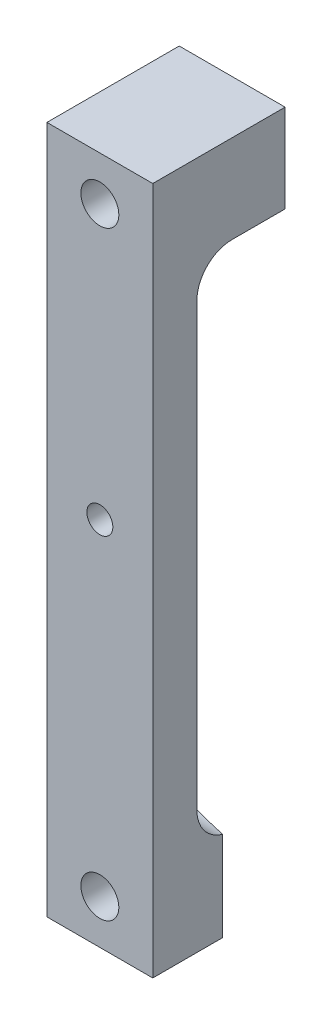
ISO-10303-21;
HEADER;
FILE_DESCRIPTION(('STEP AP214'),'2;1');
FILE_NAME('part.step','',(''),(''),'','','');
FILE_SCHEMA(('AUTOMOTIVE_DESIGN { 1 0 10303 214 1 1 1 1 }'));
ENDSEC;
DATA;
#1=APPLICATION_CONTEXT('core data for automotive mechanical design processes');
#2=APPLICATION_PROTOCOL_DEFINITION('international standard','automotive_design',2000,#1);
#3=PRODUCT_CONTEXT('',#1,'mechanical');
#4=PRODUCT('Part','Part','',(#3));
#5=PRODUCT_RELATED_PRODUCT_CATEGORY('part','',(#4));
#6=PRODUCT_DEFINITION_FORMATION('','',#4);
#7=PRODUCT_DEFINITION_CONTEXT('part definition',#1,'design');
#8=PRODUCT_DEFINITION('design','',#6,#7);
#9=PRODUCT_DEFINITION_SHAPE('','',#8);
#10=(LENGTH_UNIT() NAMED_UNIT(*) SI_UNIT(.MILLI.,.METRE.));
#11=(NAMED_UNIT(*) PLANE_ANGLE_UNIT() SI_UNIT($,.RADIAN.));
#12=(NAMED_UNIT(*) SI_UNIT($,.STERADIAN.) SOLID_ANGLE_UNIT());
#13=UNCERTAINTY_MEASURE_WITH_UNIT(LENGTH_MEASURE(1.E-05),#10,'distance_accuracy_value','');
#14=(GEOMETRIC_REPRESENTATION_CONTEXT(3) GLOBAL_UNCERTAINTY_ASSIGNED_CONTEXT((#13)) GLOBAL_UNIT_ASSIGNED_CONTEXT((#10,
#11,#12)) REPRESENTATION_CONTEXT('',''));
#15=CARTESIAN_POINT('',(0.,0.,0.));
#16=DIRECTION('',(0.,0.,1.));
#17=DIRECTION('',(1.,0.,0.));
#18=AXIS2_PLACEMENT_3D('',#15,#16,#17);
#19=CARTESIAN_POINT('',(0.,39.,0.));
#20=DIRECTION('',(0.,0.,1.));
#21=DIRECTION('',(1.,0.,0.));
#22=AXIS2_PLACEMENT_3D('',#19,#20,#21);
#23=PLANE('',#22);
#24=CARTESIAN_POINT('',(6.00000000000001,3.,0.));
#25=DIRECTION('',(0.,0.,1.));
#26=DIRECTION('',(1.,0.,0.));
#27=AXIS2_PLACEMENT_3D('',#24,#25,#26);
#28=CIRCLE('',#27,1.4732);
#29=CARTESIAN_POINT('',(7.47320000000001,3.,0.));
#30=VERTEX_POINT('',#29);
#31=EDGE_CURVE('E158',#30,#30,#28,.T.);
#32=ORIENTED_EDGE('',*,*,#31,.T.);
#33=EDGE_LOOP('',(#32));
#34=FACE_BOUND('',#33,.T.);
#35=DIRECTION('',(0.,1.,0.));
#36=VECTOR('',#35,1.);
#37=CARTESIAN_POINT('',(12.,0.,0.));
#38=LINE('',#37,#36);
#39=CARTESIAN_POINT('',(12.,-25.,0.));
#40=VERTEX_POINT('',#39);
#41=CARTESIAN_POINT('',(12.,25.,0.));
#42=VERTEX_POINT('',#41);
#43=EDGE_CURVE('E157',#40,#42,#38,.T.);
#44=ORIENTED_EDGE('',*,*,#43,.F.);
#45=DIRECTION('',(1.,0.,0.));
#46=VECTOR('',#45,1.);
#47=CARTESIAN_POINT('',(0.,-25.,0.));
#48=LINE('',#47,#46);
#49=CARTESIAN_POINT('',(0.,-25.,0.));
#50=VERTEX_POINT('',#49);
#51=EDGE_CURVE('E358',#40,#50,#48,.F.);
#52=ORIENTED_EDGE('',*,*,#51,.T.);
#53=DIRECTION('',(0.,-1.,0.));
#54=VECTOR('',#53,1.);
#55=CARTESIAN_POINT('',(0.,39.,0.));
#56=LINE('',#55,#54);
#57=CARTESIAN_POINT('',(0.,25.,0.));
#58=VERTEX_POINT('',#57);
#59=EDGE_CURVE('E153',#58,#50,#56,.T.);
#60=ORIENTED_EDGE('',*,*,#59,.F.);
#61=DIRECTION('',(-1.,0.,0.));
#62=VECTOR('',#61,1.);
#63=CARTESIAN_POINT('',(12.,25.,0.));
#64=LINE('',#63,#62);
#65=EDGE_CURVE('E152',#58,#42,#64,.F.);
#66=ORIENTED_EDGE('',*,*,#65,.T.);
#67=EDGE_LOOP('',(#44,#52,#60,#66));
#68=FACE_BOUND('',#67,.T.);
#69=ADVANCED_FACE('F32',(#34,#68),#23,.F.);
#70=CARTESIAN_POINT('',(12.,39.,5.));
#71=DIRECTION('',(0.,-1.,0.));
#72=DIRECTION('',(0.,0.,-1.));
#73=AXIS2_PLACEMENT_3D('',#70,#71,#72);
#74=PLANE('',#73);
#75=DIRECTION('',(0.,0.,-1.));
#76=VECTOR('',#75,1.);
#77=CARTESIAN_POINT('',(12.,39.,5.));
#78=LINE('',#77,#76);
#79=CARTESIAN_POINT('',(12.,39.,5.));
#80=VERTEX_POINT('',#79);
#81=CARTESIAN_POINT('',(12.,39.,-9.99999999999999));
#82=VERTEX_POINT('',#81);
#83=EDGE_CURVE('E135',#80,#82,#78,.T.);
#84=ORIENTED_EDGE('',*,*,#83,.T.);
#85=DIRECTION('',(1.,0.,0.));
#86=VECTOR('',#85,1.);
#87=CARTESIAN_POINT('',(0.,39.,-9.99999999999999));
#88=LINE('',#87,#86);
#89=CARTESIAN_POINT('',(0.,39.,-9.99999999999999));
#90=VERTEX_POINT('',#89);
#91=EDGE_CURVE('E179',#90,#82,#88,.T.);
#92=ORIENTED_EDGE('',*,*,#91,.F.);
#93=DIRECTION('',(0.,0.,-1.));
#94=VECTOR('',#93,1.);
#95=CARTESIAN_POINT('',(0.,39.,5.));
#96=LINE('',#95,#94);
#97=CARTESIAN_POINT('',(0.,39.,5.));
#98=VERTEX_POINT('',#97);
#99=EDGE_CURVE('E130',#98,#90,#96,.T.);
#100=ORIENTED_EDGE('',*,*,#99,.F.);
#101=DIRECTION('',(-1.,0.,0.));
#102=VECTOR('',#101,1.);
#103=CARTESIAN_POINT('',(12.,39.,5.));
#104=LINE('',#103,#102);
#105=EDGE_CURVE('E166',#80,#98,#104,.T.);
#106=ORIENTED_EDGE('',*,*,#105,.F.);
#107=EDGE_LOOP('',(#84,#92,#100,#106));
#108=FACE_BOUND('',#107,.T.);
#109=ADVANCED_FACE('F34',(#108),#74,.F.);
#110=CARTESIAN_POINT('',(0.,39.,5.));
#111=DIRECTION('',(1.,0.,0.));
#112=DIRECTION('',(0.,0.,-1.));
#113=AXIS2_PLACEMENT_3D('',#110,#111,#112);
#114=PLANE('',#113);
#115=DIRECTION('',(0.,0.,1.));
#116=VECTOR('',#115,1.);
#117=CARTESIAN_POINT('',(0.,-29.,-9.99999999999999));
#118=LINE('',#117,#116);
#119=CARTESIAN_POINT('',(0.,-29.,-6.192));
#120=VERTEX_POINT('',#119);
#121=CARTESIAN_POINT('',(0.,-29.,-4.));
#122=VERTEX_POINT('',#121);
#123=EDGE_CURVE('E126',#120,#122,#118,.T.);
#124=ORIENTED_EDGE('',*,*,#123,.F.);
#125=DIRECTION('',(0.,1.,0.));
#126=VECTOR('',#125,1.);
#127=CARTESIAN_POINT('',(0.,-52.9269974676532,-6.192));
#128=LINE('',#127,#126);
#129=CARTESIAN_POINT('',(0.,-39.,-6.192));
#130=VERTEX_POINT('',#129);
#131=EDGE_CURVE('E111',#130,#120,#128,.T.);
#132=ORIENTED_EDGE('',*,*,#131,.F.);
#133=DIRECTION('',(0.,0.,-1.));
#134=VECTOR('',#133,1.);
#135=CARTESIAN_POINT('',(0.,-39.,5.));
#136=LINE('',#135,#134);
#137=CARTESIAN_POINT('',(0.,-39.,5.));
#138=VERTEX_POINT('',#137);
#139=EDGE_CURVE('E123',#138,#130,#136,.T.);
#140=ORIENTED_EDGE('',*,*,#139,.F.);
#141=DIRECTION('',(0.,-1.,0.));
#142=VECTOR('',#141,1.);
#143=CARTESIAN_POINT('',(0.,39.,5.));
#144=LINE('',#143,#142);
#145=EDGE_CURVE('E169',#98,#138,#144,.T.);
#146=ORIENTED_EDGE('',*,*,#145,.F.);
#147=ORIENTED_EDGE('',*,*,#99,.T.);
#148=DIRECTION('',(0.,1.,0.));
#149=VECTOR('',#148,1.);
#150=CARTESIAN_POINT('',(0.,39.,-9.99999999999999));
#151=LINE('',#150,#149);
#152=CARTESIAN_POINT('',(0.,29.,-9.99999999999999));
#153=VERTEX_POINT('',#152);
#154=EDGE_CURVE('E187',#153,#90,#151,.T.);
#155=ORIENTED_EDGE('',*,*,#154,.F.);
#156=DIRECTION('',(0.,0.,1.));
#157=VECTOR('',#156,1.);
#158=CARTESIAN_POINT('',(0.,29.,-9.99999999999999));
#159=LINE('',#158,#157);
#160=CARTESIAN_POINT('',(0.,29.,-4.));
#161=VERTEX_POINT('',#160);
#162=EDGE_CURVE('E139',#153,#161,#159,.T.);
#163=ORIENTED_EDGE('',*,*,#162,.T.);
#164=CARTESIAN_POINT('',(0.,25.,-4.));
#165=DIRECTION('',(1.,0.,0.));
#166=DIRECTION('',(0.,0.,-1.));
#167=AXIS2_PLACEMENT_3D('',#164,#165,#166);
#168=CIRCLE('',#167,4.);
#169=EDGE_CURVE('E348',#161,#58,#168,.T.);
#170=ORIENTED_EDGE('',*,*,#169,.T.);
#171=ORIENTED_EDGE('',*,*,#59,.T.);
#172=CARTESIAN_POINT('',(0.,-25.,-4.));
#173=DIRECTION('',(1.,0.,0.));
#174=DIRECTION('',(0.,0.,-1.));
#175=AXIS2_PLACEMENT_3D('',#172,#173,#174);
#176=CIRCLE('',#175,4.);
#177=EDGE_CURVE('E345',#50,#122,#176,.T.);
#178=ORIENTED_EDGE('',*,*,#177,.T.);
#179=EDGE_LOOP('',(#124,#132,#140,#146,#147,#155,#163,#170,#171,#178));
#180=FACE_BOUND('',#179,.T.);
#181=ADVANCED_FACE('F122',(#180),#114,.F.);
#182=CARTESIAN_POINT('',(0.,-39.,5.));
#183=DIRECTION('',(0.,1.,0.));
#184=DIRECTION('',(0.,0.,1.));
#185=AXIS2_PLACEMENT_3D('',#182,#183,#184);
#186=PLANE('',#185);
#187=ORIENTED_EDGE('',*,*,#139,.T.);
#188=DIRECTION('',(-0.965016494472311,0.,-0.262189178640865));
#189=VECTOR('',#188,1.);
#190=CARTESIAN_POINT('',(0.,-39.,-6.192));
#191=LINE('',#190,#189);
#192=CARTESIAN_POINT('',(12.,-39.,-2.93167215927141));
#193=VERTEX_POINT('',#192);
#194=EDGE_CURVE('E108',#193,#130,#191,.T.);
#195=ORIENTED_EDGE('',*,*,#194,.F.);
#196=DIRECTION('',(0.,0.,-1.));
#197=VECTOR('',#196,1.);
#198=CARTESIAN_POINT('',(12.,-39.,5.));
#199=LINE('',#198,#197);
#200=CARTESIAN_POINT('',(12.,-39.,5.));
#201=VERTEX_POINT('',#200);
#202=EDGE_CURVE('E131',#201,#193,#199,.T.);
#203=ORIENTED_EDGE('',*,*,#202,.F.);
#204=DIRECTION('',(1.,0.,0.));
#205=VECTOR('',#204,1.);
#206=CARTESIAN_POINT('',(0.,-39.,5.));
#207=LINE('',#206,#205);
#208=EDGE_CURVE('E129',#138,#201,#207,.T.);
#209=ORIENTED_EDGE('',*,*,#208,.F.);
#210=EDGE_LOOP('',(#187,#195,#203,#209));
#211=FACE_BOUND('',#210,.T.);
#212=ADVANCED_FACE('F128',(#211),#186,.F.);
#213=CARTESIAN_POINT('',(12.,0.,5.));
#214=DIRECTION('',(-1.,0.,0.));
#215=DIRECTION('',(0.,0.,1.));
#216=AXIS2_PLACEMENT_3D('',#213,#214,#215);
#217=PLANE('',#216);
#218=ORIENTED_EDGE('',*,*,#202,.T.);
#219=DIRECTION('',(0.,1.,0.));
#220=VECTOR('',#219,1.);
#221=CARTESIAN_POINT('',(12.,-52.9269974676532,-2.93167215927141));
#222=LINE('',#221,#220);
#223=CARTESIAN_POINT('',(12.,-28.8546952700213,-2.93167215927141));
#224=VERTEX_POINT('',#223);
#225=EDGE_CURVE('E113',#193,#224,#222,.T.);
#226=ORIENTED_EDGE('',*,*,#225,.T.);
#227=CARTESIAN_POINT('',(12.,-25.,-4.));
#228=DIRECTION('',(-1.,0.,0.));
#229=DIRECTION('',(0.,0.,1.));
#230=AXIS2_PLACEMENT_3D('',#227,#228,#229);
#231=CIRCLE('',#230,4.);
#232=EDGE_CURVE('E349',#224,#40,#231,.T.);
#233=ORIENTED_EDGE('',*,*,#232,.T.);
#234=ORIENTED_EDGE('',*,*,#43,.T.);
#235=CARTESIAN_POINT('',(12.,25.,-4.));
#236=DIRECTION('',(-1.,0.,0.));
#237=DIRECTION('',(0.,0.,1.));
#238=AXIS2_PLACEMENT_3D('',#235,#236,#237);
#239=CIRCLE('',#238,4.);
#240=CARTESIAN_POINT('',(12.,29.,-4.));
#241=VERTEX_POINT('',#240);
#242=EDGE_CURVE('E41',#42,#241,#239,.T.);
#243=ORIENTED_EDGE('',*,*,#242,.T.);
#244=DIRECTION('',(0.,0.,1.));
#245=VECTOR('',#244,1.);
#246=CARTESIAN_POINT('',(12.,29.,-9.99999999999999));
#247=LINE('',#246,#245);
#248=CARTESIAN_POINT('',(12.,29.,-9.99999999999999));
#249=VERTEX_POINT('',#248);
#250=EDGE_CURVE('E142',#249,#241,#247,.T.);
#251=ORIENTED_EDGE('',*,*,#250,.F.);
#252=DIRECTION('',(0.,-1.,0.));
#253=VECTOR('',#252,1.);
#254=CARTESIAN_POINT('',(12.,39.,-9.99999999999999));
#255=LINE('',#254,#253);
#256=EDGE_CURVE('E185',#82,#249,#255,.T.);
#257=ORIENTED_EDGE('',*,*,#256,.F.);
#258=ORIENTED_EDGE('',*,*,#83,.F.);
#259=DIRECTION('',(0.,1.,0.));
#260=VECTOR('',#259,1.);
#261=CARTESIAN_POINT('',(12.,-39.,5.));
#262=LINE('',#261,#260);
#263=EDGE_CURVE('E172',#201,#80,#262,.T.);
#264=ORIENTED_EDGE('',*,*,#263,.F.);
#265=EDGE_LOOP('',(#218,#226,#233,#234,#243,#251,#257,#258,#264));
#266=FACE_BOUND('',#265,.T.);
#267=ADVANCED_FACE('F189',(#266),#217,.F.);
#268=CARTESIAN_POINT('',(0.,39.,5.));
#269=DIRECTION('',(0.,0.,1.));
#270=DIRECTION('',(1.,0.,0.));
#271=AXIS2_PLACEMENT_3D('',#268,#269,#270);
#272=PLANE('',#271);
#273=CARTESIAN_POINT('',(6.00000000000001,34.,5.));
#274=DIRECTION('',(0.,0.,1.));
#275=DIRECTION('',(1.,0.,0.));
#276=AXIS2_PLACEMENT_3D('',#273,#274,#275);
#277=CIRCLE('',#276,2.15264999999999);
#278=CARTESIAN_POINT('',(8.15264999999999,34.,5.));
#279=VERTEX_POINT('',#278);
#280=EDGE_CURVE('E334',#279,#279,#277,.T.);
#281=ORIENTED_EDGE('',*,*,#280,.F.);
#282=EDGE_LOOP('',(#281));
#283=FACE_BOUND('',#282,.T.);
#284=CARTESIAN_POINT('',(6.00000000000001,-34.,5.));
#285=DIRECTION('',(0.,0.,1.));
#286=DIRECTION('',(1.,0.,0.));
#287=AXIS2_PLACEMENT_3D('',#284,#285,#286);
#288=CIRCLE('',#287,2.15264999999999);
#289=CARTESIAN_POINT('',(8.15264999999999,-34.,5.));
#290=VERTEX_POINT('',#289);
#291=EDGE_CURVE('E335',#290,#290,#288,.T.);
#292=ORIENTED_EDGE('',*,*,#291,.F.);
#293=EDGE_LOOP('',(#292));
#294=FACE_BOUND('',#293,.T.);
#295=CARTESIAN_POINT('',(6.00000000000001,3.,5.));
#296=DIRECTION('',(0.,0.,1.));
#297=DIRECTION('',(1.,0.,0.));
#298=AXIS2_PLACEMENT_3D('',#295,#296,#297);
#299=CIRCLE('',#298,1.4732);
#300=CARTESIAN_POINT('',(7.47320000000001,3.,5.));
#301=VERTEX_POINT('',#300);
#302=EDGE_CURVE('E147',#301,#301,#299,.T.);
#303=ORIENTED_EDGE('',*,*,#302,.F.);
#304=EDGE_LOOP('',(#303));
#305=FACE_BOUND('',#304,.T.);
#306=ORIENTED_EDGE('',*,*,#105,.T.);
#307=ORIENTED_EDGE('',*,*,#145,.T.);
#308=ORIENTED_EDGE('',*,*,#208,.T.);
#309=ORIENTED_EDGE('',*,*,#263,.T.);
#310=EDGE_LOOP('',(#306,#307,#308,#309));
#311=FACE_BOUND('',#310,.T.);
#312=ADVANCED_FACE('F205',(#283,#294,#305,#311),#272,.T.);
#313=CARTESIAN_POINT('',(6.00000000000001,3.,0.));
#314=DIRECTION('',(0.,0.,1.));
#315=DIRECTION('',(1.,0.,0.));
#316=AXIS2_PLACEMENT_3D('',#313,#314,#315);
#317=CYLINDRICAL_SURFACE('',#316,1.4732);
#318=ORIENTED_EDGE('',*,*,#31,.F.);
#319=EDGE_LOOP('',(#318));
#320=FACE_BOUND('',#319,.T.);
#321=ORIENTED_EDGE('',*,*,#302,.T.);
#322=EDGE_LOOP('',(#321));
#323=FACE_BOUND('',#322,.T.);
#324=ADVANCED_FACE('F202',(#320,#323),#317,.F.);
#325=CARTESIAN_POINT('',(0.,29.,-9.99999999999999));
#326=DIRECTION('',(0.,1.,0.));
#327=DIRECTION('',(-1.,0.,0.));
#328=AXIS2_PLACEMENT_3D('',#325,#326,#327);
#329=PLANE('',#328);
#330=ORIENTED_EDGE('',*,*,#250,.T.);
#331=DIRECTION('',(-1.,0.,0.));
#332=VECTOR('',#331,1.);
#333=CARTESIAN_POINT('',(0.,29.,-4.));
#334=LINE('',#333,#332);
#335=EDGE_CURVE('E357',#241,#161,#334,.T.);
#336=ORIENTED_EDGE('',*,*,#335,.T.);
#337=ORIENTED_EDGE('',*,*,#162,.F.);
#338=DIRECTION('',(-1.,0.,0.));
#339=VECTOR('',#338,1.);
#340=CARTESIAN_POINT('',(0.,29.,-9.99999999999999));
#341=LINE('',#340,#339);
#342=EDGE_CURVE('E143',#249,#153,#341,.T.);
#343=ORIENTED_EDGE('',*,*,#342,.F.);
#344=EDGE_LOOP('',(#330,#336,#337,#343));
#345=FACE_BOUND('',#344,.T.);
#346=ADVANCED_FACE('F204',(#345),#329,.F.);
#347=CARTESIAN_POINT('',(0.,39.,-9.99999999999999));
#348=DIRECTION('',(0.,0.,1.));
#349=DIRECTION('',(1.,0.,0.));
#350=AXIS2_PLACEMENT_3D('',#347,#348,#349);
#351=PLANE('',#350);
#352=CARTESIAN_POINT('',(6.00000000000001,34.,-9.99999999999999));
#353=DIRECTION('',(0.,0.,1.));
#354=DIRECTION('',(1.,0.,0.));
#355=AXIS2_PLACEMENT_3D('',#352,#353,#354);
#356=CIRCLE('',#355,2.15265);
#357=CARTESIAN_POINT('',(8.15265,34.,-9.99999999999999));
#358=VERTEX_POINT('',#357);
#359=EDGE_CURVE('E331',#358,#358,#356,.T.);
#360=ORIENTED_EDGE('',*,*,#359,.T.);
#361=EDGE_LOOP('',(#360));
#362=FACE_BOUND('',#361,.T.);
#363=ORIENTED_EDGE('',*,*,#154,.T.);
#364=ORIENTED_EDGE('',*,*,#91,.T.);
#365=ORIENTED_EDGE('',*,*,#256,.T.);
#366=ORIENTED_EDGE('',*,*,#342,.T.);
#367=EDGE_LOOP('',(#363,#364,#365,#366));
#368=FACE_BOUND('',#367,.T.);
#369=ADVANCED_FACE('F184',(#362,#368),#351,.F.);
#370=CARTESIAN_POINT('',(0.,-29.,-9.99999999999999));
#371=DIRECTION('',(0.,-1.,0.));
#372=DIRECTION('',(0.,0.,-1.));
#373=AXIS2_PLACEMENT_3D('',#370,#371,#372);
#374=PLANE('',#373);
#375=DIRECTION('',(1.,0.,0.));
#376=VECTOR('',#375,1.);
#377=CARTESIAN_POINT('',(12.,-29.,-4.));
#378=LINE('',#377,#376);
#379=CARTESIAN_POINT('',(8.06790031094598,-29.,-4.));
#380=VERTEX_POINT('',#379);
#381=EDGE_CURVE('E133',#122,#380,#378,.T.);
#382=ORIENTED_EDGE('',*,*,#381,.T.);
#383=DIRECTION('',(-0.965016494472311,0.,-0.262189178640865));
#384=VECTOR('',#383,1.);
#385=CARTESIAN_POINT('',(-0.963488286886693,-29.,-6.45377397382939));
#386=LINE('',#385,#384);
#387=EDGE_CURVE('E48',#380,#120,#386,.T.);
#388=ORIENTED_EDGE('',*,*,#387,.T.);
#389=ORIENTED_EDGE('',*,*,#123,.T.);
#390=EDGE_LOOP('',(#382,#388,#389));
#391=FACE_BOUND('',#390,.T.);
#392=ADVANCED_FACE('F279',(#391),#374,.F.);
#393=CARTESIAN_POINT('',(0.,-25.,-4.));
#394=DIRECTION('',(-1.,0.,0.));
#395=DIRECTION('',(0.,0.,1.));
#396=AXIS2_PLACEMENT_3D('',#393,#394,#395);
#397=CYLINDRICAL_SURFACE('',#396,4.);
#398=ORIENTED_EDGE('',*,*,#232,.F.);
#399=CARTESIAN_POINT('',(8.06790031094598,-25.,-4.));
#400=DIRECTION('',(-0.262189178640865,0.,0.965016494472311));
#401=DIRECTION('',(-0.965016494472311,0.,-0.262189178640865));
#402=AXIS2_PLACEMENT_3D('',#399,#400,#401);
#403=ELLIPSE('',#402,15.2561597726313,4.);
#404=EDGE_CURVE('E11',#224,#380,#403,.F.);
#405=ORIENTED_EDGE('',*,*,#404,.T.);
#406=ORIENTED_EDGE('',*,*,#381,.F.);
#407=ORIENTED_EDGE('',*,*,#177,.F.);
#408=ORIENTED_EDGE('',*,*,#51,.F.);
#409=EDGE_LOOP('',(#398,#405,#406,#407,#408));
#410=FACE_BOUND('',#409,.T.);
#411=ADVANCED_FACE('F287',(#410),#397,.F.);
#412=CARTESIAN_POINT('',(0.,25.,-4.));
#413=DIRECTION('',(1.,0.,0.));
#414=DIRECTION('',(0.,1.,0.));
#415=AXIS2_PLACEMENT_3D('',#412,#413,#414);
#416=CYLINDRICAL_SURFACE('',#415,4.);
#417=ORIENTED_EDGE('',*,*,#242,.F.);
#418=ORIENTED_EDGE('',*,*,#65,.F.);
#419=ORIENTED_EDGE('',*,*,#169,.F.);
#420=ORIENTED_EDGE('',*,*,#335,.F.);
#421=EDGE_LOOP('',(#417,#418,#419,#420));
#422=FACE_BOUND('',#421,.T.);
#423=ADVANCED_FACE('F295',(#422),#416,.F.);
#424=CARTESIAN_POINT('',(0.,-52.9269974676532,-6.192));
#425=DIRECTION('',(-0.262189178640865,0.,0.965016494472311));
#426=DIRECTION('',(0.965016494472311,0.,0.262189178640865));
#427=AXIS2_PLACEMENT_3D('',#424,#425,#426);
#428=PLANE('',#427);
#429=CARTESIAN_POINT('',(6.00000000000001,-34.,-4.5618360796357));
#430=DIRECTION('',(-0.262189178640865,0.,0.965016494472311));
#431=DIRECTION('',(0.965016494472311,0.,0.262189178640865));
#432=AXIS2_PLACEMENT_3D('',#429,#430,#431);
#433=ELLIPSE('',#432,2.23068726009404,2.15264999999999);
#434=CARTESIAN_POINT('',(8.15265,-34.,-3.976974019107));
#435=VERTEX_POINT('',#434);
#436=EDGE_CURVE('E36',#435,#435,#433,.T.);
#437=ORIENTED_EDGE('',*,*,#436,.T.);
#438=EDGE_LOOP('',(#437));
#439=FACE_BOUND('',#438,.T.);
#440=ORIENTED_EDGE('',*,*,#404,.F.);
#441=ORIENTED_EDGE('',*,*,#225,.F.);
#442=ORIENTED_EDGE('',*,*,#194,.T.);
#443=ORIENTED_EDGE('',*,*,#131,.T.);
#444=ORIENTED_EDGE('',*,*,#387,.F.);
#445=EDGE_LOOP('',(#440,#441,#442,#443,#444));
#446=FACE_BOUND('',#445,.T.);
#447=ADVANCED_FACE('F110',(#439,#446),#428,.F.);
#448=CARTESIAN_POINT('',(6.00000000000001,-34.,5.));
#449=DIRECTION('',(0.,0.,1.));
#450=DIRECTION('',(1.,0.,0.));
#451=AXIS2_PLACEMENT_3D('',#448,#449,#450);
#452=CYLINDRICAL_SURFACE('',#451,2.15264999999999);
#453=ORIENTED_EDGE('',*,*,#291,.T.);
#454=EDGE_LOOP('',(#453));
#455=FACE_BOUND('',#454,.T.);
#456=ORIENTED_EDGE('',*,*,#436,.F.);
#457=EDGE_LOOP('',(#456));
#458=FACE_BOUND('',#457,.T.);
#459=ADVANCED_FACE('F310',(#455,#458),#452,.F.);
#460=CARTESIAN_POINT('',(6.00000000000001,34.,5.));
#461=DIRECTION('',(0.,0.,1.));
#462=DIRECTION('',(1.,0.,0.));
#463=AXIS2_PLACEMENT_3D('',#460,#461,#462);
#464=CYLINDRICAL_SURFACE('',#463,2.15264999999999);
#465=ORIENTED_EDGE('',*,*,#359,.F.);
#466=EDGE_LOOP('',(#465));
#467=FACE_BOUND('',#466,.T.);
#468=ORIENTED_EDGE('',*,*,#280,.T.);
#469=EDGE_LOOP('',(#468));
#470=FACE_BOUND('',#469,.T.);
#471=ADVANCED_FACE('F318',(#467,#470),#464,.F.);
#472=CLOSED_SHELL('',(#69,#109,#181,#212,#267,#312,#324,#346,#369,#392,#411,#423,#447,#459,#471));
#473=MANIFOLD_SOLID_BREP('B2',#472);
#474=ADVANCED_BREP_SHAPE_REPRESENTATION('',(#18,#473),#14);
#475=SHAPE_DEFINITION_REPRESENTATION(#9,#474);
ENDSEC;
END-ISO-10303-21;
